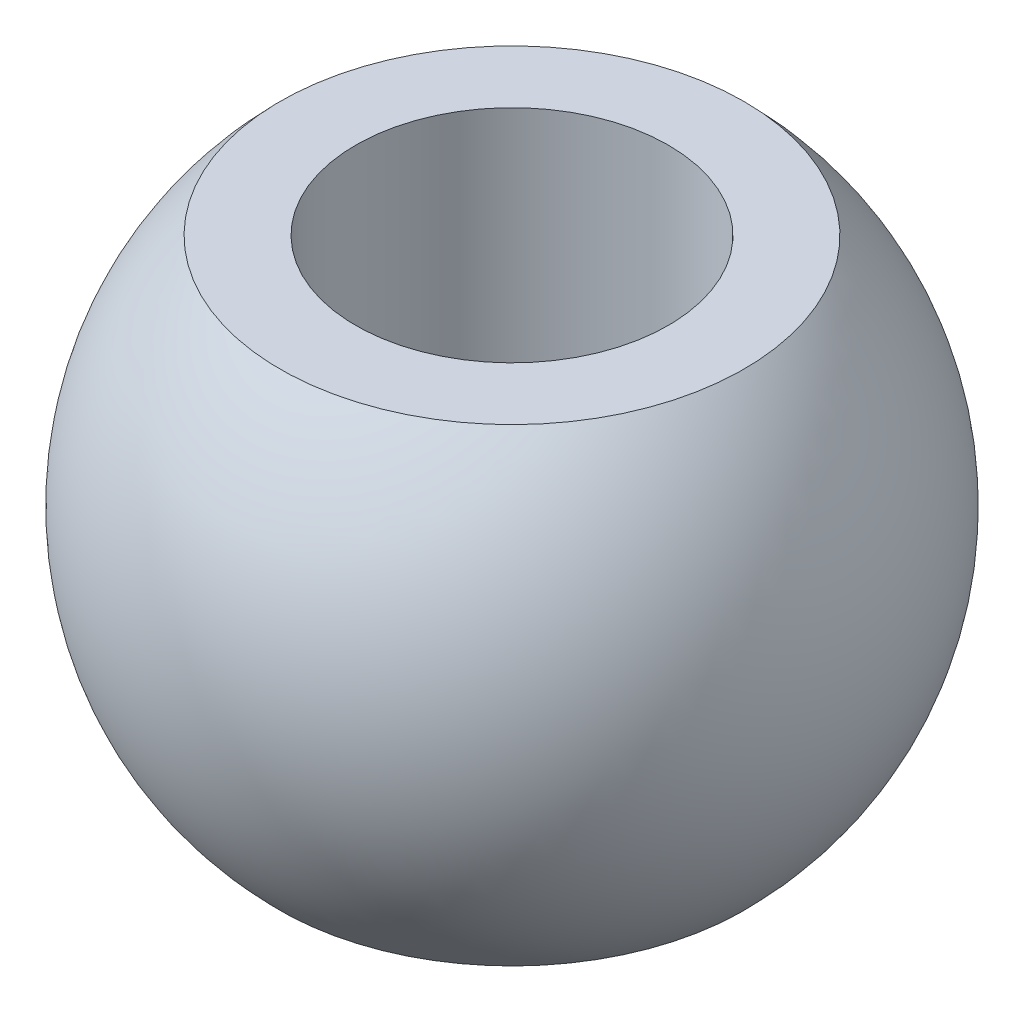
ISO-10303-21;
HEADER;
FILE_DESCRIPTION(('STEP AP214'),'2;1');
FILE_NAME('part.step','',(''),(''),'','','');
FILE_SCHEMA(('AUTOMOTIVE_DESIGN { 1 0 10303 214 1 1 1 1 }'));
ENDSEC;
DATA;
#1=APPLICATION_CONTEXT('core data for automotive mechanical design processes');
#2=APPLICATION_PROTOCOL_DEFINITION('international standard','automotive_design',2000,#1);
#3=PRODUCT_CONTEXT('',#1,'mechanical');
#4=PRODUCT('Part','Part','',(#3));
#5=PRODUCT_RELATED_PRODUCT_CATEGORY('part','',(#4));
#6=PRODUCT_DEFINITION_FORMATION('','',#4);
#7=PRODUCT_DEFINITION_CONTEXT('part definition',#1,'design');
#8=PRODUCT_DEFINITION('design','',#6,#7);
#9=PRODUCT_DEFINITION_SHAPE('','',#8);
#10=(LENGTH_UNIT() NAMED_UNIT(*) SI_UNIT(.MILLI.,.METRE.));
#11=(NAMED_UNIT(*) PLANE_ANGLE_UNIT() SI_UNIT($,.RADIAN.));
#12=(NAMED_UNIT(*) SI_UNIT($,.STERADIAN.) SOLID_ANGLE_UNIT());
#13=UNCERTAINTY_MEASURE_WITH_UNIT(LENGTH_MEASURE(1.E-05),#10,'distance_accuracy_value','');
#14=(GEOMETRIC_REPRESENTATION_CONTEXT(3) GLOBAL_UNCERTAINTY_ASSIGNED_CONTEXT((#13)) GLOBAL_UNIT_ASSIGNED_CONTEXT((#10,
#11,#12)) REPRESENTATION_CONTEXT('',''));
#15=CARTESIAN_POINT('',(0.,0.,0.));
#16=DIRECTION('',(0.,0.,1.));
#17=DIRECTION('',(1.,0.,0.));
#18=AXIS2_PLACEMENT_3D('',#15,#16,#17);
#19=CARTESIAN_POINT('',(3.,-4.5,0.));
#20=DIRECTION('',(0.,-1.,0.));
#21=DIRECTION('',(0.,0.,-1.));
#22=AXIS2_PLACEMENT_3D('',#19,#20,#21);
#23=PLANE('',#22);
#24=CARTESIAN_POINT('',(0.,-4.5,0.));
#25=DIRECTION('',(0.,-1.,0.));
#26=DIRECTION('',(0.,0.,-1.));
#27=AXIS2_PLACEMENT_3D('',#24,#25,#26);
#28=CIRCLE('',#27,4.45184231526679);
#29=CARTESIAN_POINT('',(0.,-4.5,-4.45184231526679));
#30=VERTEX_POINT('',#29);
#31=EDGE_CURVE('E10',#30,#30,#28,.T.);
#32=ORIENTED_EDGE('',*,*,#31,.T.);
#33=EDGE_LOOP('',(#32));
#34=FACE_BOUND('',#33,.T.);
#35=CARTESIAN_POINT('',(0.,-4.5,0.));
#36=DIRECTION('',(0.,-1.,0.));
#37=DIRECTION('',(0.,0.,-1.));
#38=AXIS2_PLACEMENT_3D('',#35,#36,#37);
#39=CIRCLE('',#38,3.);
#40=CARTESIAN_POINT('',(0.,-4.5,-3.));
#41=VERTEX_POINT('',#40);
#42=EDGE_CURVE('E45',#41,#41,#39,.T.);
#43=ORIENTED_EDGE('',*,*,#42,.F.);
#44=EDGE_LOOP('',(#43));
#45=FACE_BOUND('',#44,.T.);
#46=ADVANCED_FACE('F31',(#34,#45),#23,.T.);
#47=CARTESIAN_POINT('',(0.,0.,0.));
#48=DIRECTION('',(0.,-1.,0.));
#49=DIRECTION('',(1.,0.,0.));
#50=AXIS2_PLACEMENT_3D('',#47,#48,#49);
#51=SPHERICAL_SURFACE('',#50,6.33);
#52=CARTESIAN_POINT('',(0.,4.5,0.));
#53=DIRECTION('',(0.,-1.,0.));
#54=DIRECTION('',(0.,0.,-1.));
#55=AXIS2_PLACEMENT_3D('',#52,#53,#54);
#56=CIRCLE('',#55,4.45184231526679);
#57=CARTESIAN_POINT('',(0.,4.5,-4.45184231526679));
#58=VERTEX_POINT('',#57);
#59=EDGE_CURVE('E37',#58,#58,#56,.T.);
#60=ORIENTED_EDGE('',*,*,#59,.T.);
#61=EDGE_LOOP('',(#60));
#62=FACE_BOUND('',#61,.T.);
#63=ORIENTED_EDGE('',*,*,#31,.F.);
#64=EDGE_LOOP('',(#63));
#65=FACE_BOUND('',#64,.T.);
#66=ADVANCED_FACE('F55',(#62,#65),#51,.T.);
#67=CARTESIAN_POINT('',(3.,4.5,0.));
#68=DIRECTION('',(0.,1.,0.));
#69=DIRECTION('',(0.,0.,1.));
#70=AXIS2_PLACEMENT_3D('',#67,#68,#69);
#71=PLANE('',#70);
#72=CARTESIAN_POINT('',(0.,4.5,0.));
#73=DIRECTION('',(0.,-1.,0.));
#74=DIRECTION('',(0.,0.,-1.));
#75=AXIS2_PLACEMENT_3D('',#72,#73,#74);
#76=CIRCLE('',#75,3.);
#77=CARTESIAN_POINT('',(0.,4.5,-3.));
#78=VERTEX_POINT('',#77);
#79=EDGE_CURVE('E41',#78,#78,#76,.T.);
#80=ORIENTED_EDGE('',*,*,#79,.T.);
#81=EDGE_LOOP('',(#80));
#82=FACE_BOUND('',#81,.T.);
#83=ORIENTED_EDGE('',*,*,#59,.F.);
#84=EDGE_LOOP('',(#83));
#85=FACE_BOUND('',#84,.T.);
#86=ADVANCED_FACE('F59',(#82,#85),#71,.T.);
#87=CARTESIAN_POINT('',(0.,-11.1,0.));
#88=DIRECTION('',(0.,-1.,0.));
#89=DIRECTION('',(0.,0.,-1.));
#90=AXIS2_PLACEMENT_3D('',#87,#88,#89);
#91=CYLINDRICAL_SURFACE('',#90,3.);
#92=ORIENTED_EDGE('',*,*,#42,.T.);
#93=EDGE_LOOP('',(#92));
#94=FACE_BOUND('',#93,.T.);
#95=ORIENTED_EDGE('',*,*,#79,.F.);
#96=EDGE_LOOP('',(#95));
#97=FACE_BOUND('',#96,.T.);
#98=ADVANCED_FACE('F51',(#94,#97),#91,.F.);
#99=CLOSED_SHELL('',(#46,#66,#86,#98));
#100=MANIFOLD_SOLID_BREP('B2',#99);
#101=ADVANCED_BREP_SHAPE_REPRESENTATION('',(#18,#100),#14);
#102=SHAPE_DEFINITION_REPRESENTATION(#9,#101);
ENDSEC;
END-ISO-10303-21;
